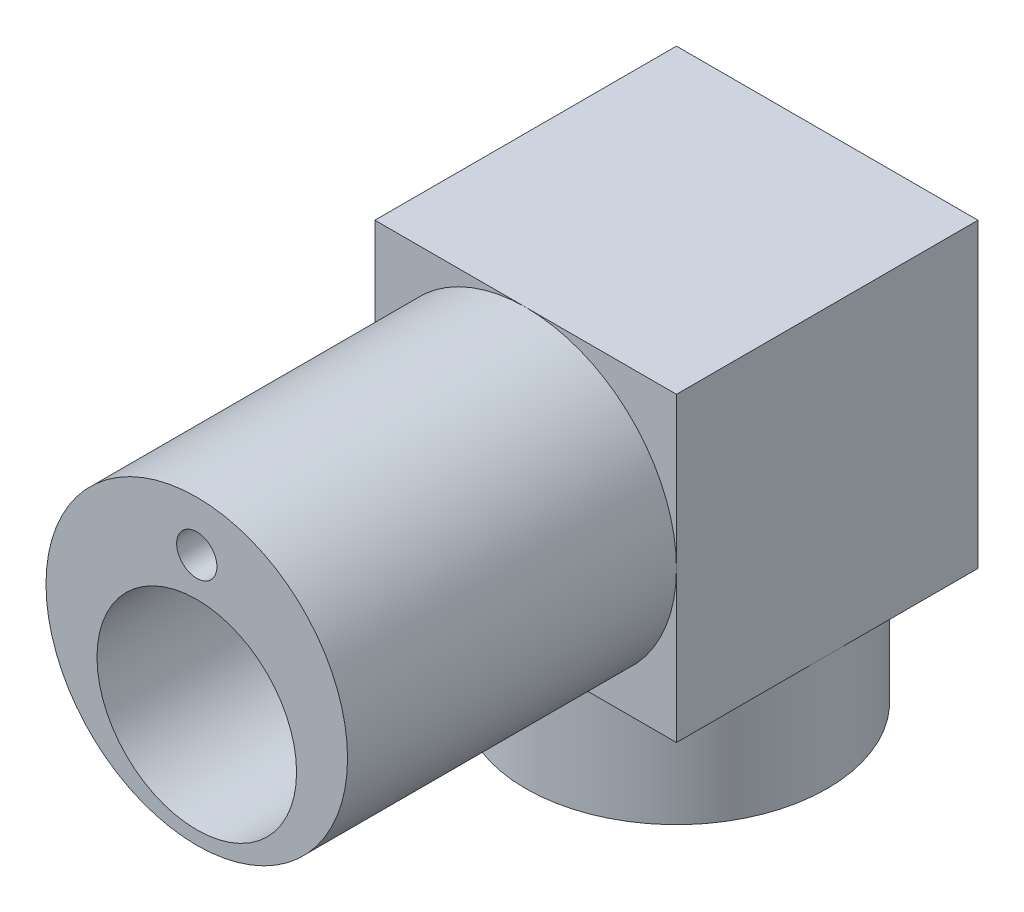
ISO-10303-21;
HEADER;
FILE_DESCRIPTION(('STEP AP214'),'2;1');
FILE_NAME('part.step','',(''),(''),'','','');
FILE_SCHEMA(('AUTOMOTIVE_DESIGN { 1 0 10303 214 1 1 1 1 }'));
ENDSEC;
DATA;
#1=APPLICATION_CONTEXT('core data for automotive mechanical design processes');
#2=APPLICATION_PROTOCOL_DEFINITION('international standard','automotive_design',2000,#1);
#3=PRODUCT_CONTEXT('',#1,'mechanical');
#4=PRODUCT('Part','Part','',(#3));
#5=PRODUCT_RELATED_PRODUCT_CATEGORY('part','',(#4));
#6=PRODUCT_DEFINITION_FORMATION('','',#4);
#7=PRODUCT_DEFINITION_CONTEXT('part definition',#1,'design');
#8=PRODUCT_DEFINITION('design','',#6,#7);
#9=PRODUCT_DEFINITION_SHAPE('','',#8);
#10=(LENGTH_UNIT() NAMED_UNIT(*) SI_UNIT(.MILLI.,.METRE.));
#11=(NAMED_UNIT(*) PLANE_ANGLE_UNIT() SI_UNIT($,.RADIAN.));
#12=(NAMED_UNIT(*) SI_UNIT($,.STERADIAN.) SOLID_ANGLE_UNIT());
#13=UNCERTAINTY_MEASURE_WITH_UNIT(LENGTH_MEASURE(1.E-05),#10,'distance_accuracy_value','');
#14=(GEOMETRIC_REPRESENTATION_CONTEXT(3) GLOBAL_UNCERTAINTY_ASSIGNED_CONTEXT((#13)) GLOBAL_UNIT_ASSIGNED_CONTEXT((#10,
#11,#12)) REPRESENTATION_CONTEXT('',''));
#15=CARTESIAN_POINT('',(0.,0.,0.));
#16=DIRECTION('',(0.,0.,1.));
#17=DIRECTION('',(1.,0.,0.));
#18=AXIS2_PLACEMENT_3D('',#15,#16,#17);
#19=CARTESIAN_POINT('',(28.1,-28.1,-56.2));
#20=DIRECTION('',(0.,1.,0.));
#21=DIRECTION('',(0.,0.,1.));
#22=AXIS2_PLACEMENT_3D('',#19,#20,#21);
#23=PLANE('',#22);
#24=CARTESIAN_POINT('',(0.,-28.1,-28.1));
#25=DIRECTION('',(0.,-1.,0.));
#26=DIRECTION('',(0.,0.,-1.));
#27=AXIS2_PLACEMENT_3D('',#24,#25,#26);
#28=CIRCLE('',#27,28.1);
#29=CARTESIAN_POINT('',(0.,-28.1,0.));
#30=VERTEX_POINT('',#29);
#31=CARTESIAN_POINT('',(-28.1,-28.1,-28.1));
#32=VERTEX_POINT('',#31);
#33=EDGE_CURVE('E377',#30,#32,#28,.T.);
#34=ORIENTED_EDGE('',*,*,#33,.F.);
#35=DIRECTION('',(-1.,0.,0.));
#36=VECTOR('',#35,1.);
#37=CARTESIAN_POINT('',(28.1,-28.1,0.));
#38=LINE('',#37,#36);
#39=CARTESIAN_POINT('',(-28.1,-28.1,0.));
#40=VERTEX_POINT('',#39);
#41=EDGE_CURVE('E281',#30,#40,#38,.T.);
#42=ORIENTED_EDGE('',*,*,#41,.T.);
#43=DIRECTION('',(0.,0.,1.));
#44=VECTOR('',#43,1.);
#45=CARTESIAN_POINT('',(-28.1,-28.1,-56.2));
#46=LINE('',#45,#44);
#47=EDGE_CURVE('E270',#32,#40,#46,.T.);
#48=ORIENTED_EDGE('',*,*,#47,.F.);
#49=EDGE_LOOP('',(#34,#42,#48));
#50=FACE_BOUND('',#49,.T.);
#51=ADVANCED_FACE('F33',(#50),#23,.F.);
#52=CARTESIAN_POINT('',(0.,-28.1,-56.2));
#53=VERTEX_POINT('',#52);
#54=EDGE_CURVE('E209',#32,#53,#28,.T.);
#55=ORIENTED_EDGE('',*,*,#54,.F.);
#56=CARTESIAN_POINT('',(-28.1,-28.1,-56.2));
#57=VERTEX_POINT('',#56);
#58=EDGE_CURVE('E284',#57,#32,#46,.T.);
#59=ORIENTED_EDGE('',*,*,#58,.F.);
#60=DIRECTION('',(-1.,0.,0.));
#61=VECTOR('',#60,1.);
#62=CARTESIAN_POINT('',(28.1,-28.1,-56.2));
#63=LINE('',#62,#61);
#64=EDGE_CURVE('E266',#53,#57,#63,.T.);
#65=ORIENTED_EDGE('',*,*,#64,.F.);
#66=EDGE_LOOP('',(#55,#59,#65));
#67=FACE_BOUND('',#66,.T.);
#68=ADVANCED_FACE('F332',(#67),#23,.F.);
#69=CARTESIAN_POINT('',(28.1,-28.1,-28.1));
#70=VERTEX_POINT('',#69);
#71=EDGE_CURVE('E216',#53,#70,#28,.T.);
#72=ORIENTED_EDGE('',*,*,#71,.F.);
#73=CARTESIAN_POINT('',(28.1,-28.1,-56.2));
#74=VERTEX_POINT('',#73);
#75=EDGE_CURVE('E267',#74,#53,#63,.T.);
#76=ORIENTED_EDGE('',*,*,#75,.F.);
#77=DIRECTION('',(0.,0.,1.));
#78=VECTOR('',#77,1.);
#79=CARTESIAN_POINT('',(28.1,-28.1,-56.2));
#80=LINE('',#79,#78);
#81=EDGE_CURVE('E288',#74,#70,#80,.T.);
#82=ORIENTED_EDGE('',*,*,#81,.T.);
#83=EDGE_LOOP('',(#72,#76,#82));
#84=FACE_BOUND('',#83,.T.);
#85=ADVANCED_FACE('F339',(#84),#23,.F.);
#86=CARTESIAN_POINT('',(0.,0.,61.3));
#87=DIRECTION('',(0.,0.,-1.));
#88=DIRECTION('',(-1.,0.,0.));
#89=AXIS2_PLACEMENT_3D('',#86,#87,#88);
#90=CYLINDRICAL_SURFACE('',#89,28.1);
#91=CARTESIAN_POINT('',(0.,0.,61.3));
#92=DIRECTION('',(0.,0.,1.));
#93=DIRECTION('',(1.,0.,0.));
#94=AXIS2_PLACEMENT_3D('',#91,#92,#93);
#95=CIRCLE('',#94,28.1);
#96=CARTESIAN_POINT('',(28.1,0.,61.3));
#97=VERTEX_POINT('',#96);
#98=EDGE_CURVE('E42',#97,#97,#95,.T.);
#99=ORIENTED_EDGE('',*,*,#98,.F.);
#100=EDGE_LOOP('',(#99));
#101=FACE_BOUND('',#100,.T.);
#102=CARTESIAN_POINT('',(0.,0.,0.));
#103=DIRECTION('',(0.,0.,1.));
#104=DIRECTION('',(1.,0.,0.));
#105=AXIS2_PLACEMENT_3D('',#102,#103,#104);
#106=CIRCLE('',#105,28.1);
#107=CARTESIAN_POINT('',(28.1,0.,0.));
#108=VERTEX_POINT('',#107);
#109=CARTESIAN_POINT('',(0.,28.1,0.));
#110=VERTEX_POINT('',#109);
#111=EDGE_CURVE('E306',#108,#110,#106,.T.);
#112=ORIENTED_EDGE('',*,*,#111,.T.);
#113=CARTESIAN_POINT('',(-28.1,0.,0.));
#114=VERTEX_POINT('',#113);
#115=EDGE_CURVE('E308',#110,#114,#106,.T.);
#116=ORIENTED_EDGE('',*,*,#115,.T.);
#117=EDGE_CURVE('E390',#114,#30,#106,.T.);
#118=ORIENTED_EDGE('',*,*,#117,.T.);
#119=EDGE_CURVE('E301',#30,#108,#106,.T.);
#120=ORIENTED_EDGE('',*,*,#119,.T.);
#121=EDGE_LOOP('',(#112,#116,#118,#120));
#122=FACE_BOUND('',#121,.T.);
#123=ADVANCED_FACE('F35',(#101,#122),#90,.T.);
#124=CARTESIAN_POINT('',(0.,0.,61.3));
#125=DIRECTION('',(0.,0.,1.));
#126=DIRECTION('',(1.,0.,0.));
#127=AXIS2_PLACEMENT_3D('',#124,#125,#126);
#128=PLANE('',#127);
#129=CARTESIAN_POINT('',(0.,18.75,61.3));
#130=DIRECTION('',(0.,0.,1.));
#131=DIRECTION('',(1.,0.,0.));
#132=AXIS2_PLACEMENT_3D('',#129,#130,#131);
#133=CIRCLE('',#132,3.75);
#134=CARTESIAN_POINT('',(3.75,18.75,61.3));
#135=VERTEX_POINT('',#134);
#136=EDGE_CURVE('E568',#135,#135,#133,.T.);
#137=ORIENTED_EDGE('',*,*,#136,.F.);
#138=EDGE_LOOP('',(#137));
#139=FACE_BOUND('',#138,.T.);
#140=CARTESIAN_POINT('',(0.,-7.,61.3));
#141=DIRECTION('',(0.,0.,1.));
#142=DIRECTION('',(1.,0.,0.));
#143=AXIS2_PLACEMENT_3D('',#140,#141,#142);
#144=CIRCLE('',#143,18.6);
#145=CARTESIAN_POINT('',(18.6,-7.,61.3));
#146=VERTEX_POINT('',#145);
#147=EDGE_CURVE('E297',#146,#146,#144,.T.);
#148=ORIENTED_EDGE('',*,*,#147,.F.);
#149=EDGE_LOOP('',(#148));
#150=FACE_BOUND('',#149,.T.);
#151=ORIENTED_EDGE('',*,*,#98,.T.);
#152=EDGE_LOOP('',(#151));
#153=FACE_BOUND('',#152,.T.);
#154=ADVANCED_FACE('F362',(#139,#150,#153),#128,.T.);
#155=CARTESIAN_POINT('',(0.,-7.,2.5));
#156=DIRECTION('',(0.,0.,1.));
#157=DIRECTION('',(1.,0.,0.));
#158=AXIS2_PLACEMENT_3D('',#155,#156,#157);
#159=CYLINDRICAL_SURFACE('',#158,18.6);
#160=CARTESIAN_POINT('',(0.,-7.,2.5));
#161=DIRECTION('',(0.,0.,1.));
#162=DIRECTION('',(1.,0.,0.));
#163=AXIS2_PLACEMENT_3D('',#160,#161,#162);
#164=CIRCLE('',#163,18.6);
#165=CARTESIAN_POINT('',(18.6,-7.,2.5));
#166=VERTEX_POINT('',#165);
#167=EDGE_CURVE('E298',#166,#166,#164,.T.);
#168=ORIENTED_EDGE('',*,*,#167,.F.);
#169=EDGE_LOOP('',(#168));
#170=FACE_BOUND('',#169,.T.);
#171=ORIENTED_EDGE('',*,*,#147,.T.);
#172=EDGE_LOOP('',(#171));
#173=FACE_BOUND('',#172,.T.);
#174=ADVANCED_FACE('F496',(#170,#173),#159,.F.);
#175=CARTESIAN_POINT('',(0.,-7.,2.5));
#176=DIRECTION('',(0.,0.,1.));
#177=DIRECTION('',(1.,0.,0.));
#178=AXIS2_PLACEMENT_3D('',#175,#176,#177);
#179=PLANE('',#178);
#180=CARTESIAN_POINT('',(0.,-7.,2.5));
#181=DIRECTION('',(0.,0.,1.));
#182=DIRECTION('',(1.,0.,0.));
#183=AXIS2_PLACEMENT_3D('',#180,#181,#182);
#184=CIRCLE('',#183,16.1);
#185=CARTESIAN_POINT('',(16.1,-7.,2.5));
#186=VERTEX_POINT('',#185);
#187=EDGE_CURVE('E254',#186,#186,#184,.T.);
#188=ORIENTED_EDGE('',*,*,#187,.F.);
#189=EDGE_LOOP('',(#188));
#190=FACE_BOUND('',#189,.T.);
#191=ORIENTED_EDGE('',*,*,#167,.T.);
#192=EDGE_LOOP('',(#191));
#193=FACE_BOUND('',#192,.T.);
#194=ADVANCED_FACE('F414',(#190,#193),#179,.T.);
#195=CARTESIAN_POINT('',(0.,0.,0.));
#196=DIRECTION('',(0.,0.,1.));
#197=DIRECTION('',(1.,0.,0.));
#198=AXIS2_PLACEMENT_3D('',#195,#196,#197);
#199=PLANE('',#198);
#200=ORIENTED_EDGE('',*,*,#111,.F.);
#201=DIRECTION('',(0.,-1.,0.));
#202=VECTOR('',#201,1.);
#203=CARTESIAN_POINT('',(28.1,-28.1,0.));
#204=LINE('',#203,#202);
#205=CARTESIAN_POINT('',(28.1,28.1,0.));
#206=VERTEX_POINT('',#205);
#207=EDGE_CURVE('E279',#206,#108,#204,.T.);
#208=ORIENTED_EDGE('',*,*,#207,.F.);
#209=DIRECTION('',(1.,0.,0.));
#210=VECTOR('',#209,1.);
#211=CARTESIAN_POINT('',(28.1,28.1,0.));
#212=LINE('',#211,#210);
#213=EDGE_CURVE('E274',#110,#206,#212,.T.);
#214=ORIENTED_EDGE('',*,*,#213,.F.);
#215=EDGE_LOOP('',(#200,#208,#214));
#216=FACE_BOUND('',#215,.T.);
#217=ADVANCED_FACE('F400',(#216),#199,.T.);
#218=ORIENTED_EDGE('',*,*,#115,.F.);
#219=CARTESIAN_POINT('',(-28.1,28.1,0.));
#220=VERTEX_POINT('',#219);
#221=EDGE_CURVE('E275',#220,#110,#212,.T.);
#222=ORIENTED_EDGE('',*,*,#221,.F.);
#223=DIRECTION('',(0.,1.,0.));
#224=VECTOR('',#223,1.);
#225=CARTESIAN_POINT('',(-28.1,-28.1,0.));
#226=LINE('',#225,#224);
#227=EDGE_CURVE('E257',#114,#220,#226,.T.);
#228=ORIENTED_EDGE('',*,*,#227,.F.);
#229=EDGE_LOOP('',(#218,#222,#228));
#230=FACE_BOUND('',#229,.T.);
#231=ADVANCED_FACE('F405',(#230),#199,.T.);
#232=ORIENTED_EDGE('',*,*,#117,.F.);
#233=EDGE_CURVE('E271',#40,#114,#226,.T.);
#234=ORIENTED_EDGE('',*,*,#233,.F.);
#235=ORIENTED_EDGE('',*,*,#41,.F.);
#236=EDGE_LOOP('',(#232,#234,#235));
#237=FACE_BOUND('',#236,.T.);
#238=ADVANCED_FACE('F407',(#237),#199,.T.);
#239=ORIENTED_EDGE('',*,*,#119,.F.);
#240=CARTESIAN_POINT('',(28.1,-28.1,0.));
#241=VERTEX_POINT('',#240);
#242=EDGE_CURVE('E262',#241,#30,#38,.T.);
#243=ORIENTED_EDGE('',*,*,#242,.F.);
#244=EDGE_CURVE('E278',#108,#241,#204,.T.);
#245=ORIENTED_EDGE('',*,*,#244,.F.);
#246=EDGE_LOOP('',(#239,#243,#245));
#247=FACE_BOUND('',#246,.T.);
#248=ADVANCED_FACE('F387',(#247),#199,.T.);
#249=CARTESIAN_POINT('',(-28.1,-28.1,-56.2));
#250=DIRECTION('',(1.,0.,0.));
#251=DIRECTION('',(0.,0.,-1.));
#252=AXIS2_PLACEMENT_3D('',#249,#250,#251);
#253=PLANE('',#252);
#254=ORIENTED_EDGE('',*,*,#233,.T.);
#255=ORIENTED_EDGE('',*,*,#227,.T.);
#256=DIRECTION('',(0.,0.,1.));
#257=VECTOR('',#256,1.);
#258=CARTESIAN_POINT('',(-28.1,28.1,-56.2));
#259=LINE('',#258,#257);
#260=CARTESIAN_POINT('',(-28.1,28.1,-56.2));
#261=VERTEX_POINT('',#260);
#262=EDGE_CURVE('E294',#261,#220,#259,.T.);
#263=ORIENTED_EDGE('',*,*,#262,.F.);
#264=DIRECTION('',(0.,1.,0.));
#265=VECTOR('',#264,1.);
#266=CARTESIAN_POINT('',(-28.1,-28.1,-56.2));
#267=LINE('',#266,#265);
#268=EDGE_CURVE('E258',#57,#261,#267,.T.);
#269=ORIENTED_EDGE('',*,*,#268,.F.);
#270=ORIENTED_EDGE('',*,*,#58,.T.);
#271=ORIENTED_EDGE('',*,*,#47,.T.);
#272=EDGE_LOOP('',(#254,#255,#263,#269,#270,#271));
#273=FACE_BOUND('',#272,.T.);
#274=ADVANCED_FACE('F394',(#273),#253,.F.);
#275=CARTESIAN_POINT('',(28.1,28.1,-56.2));
#276=DIRECTION('',(0.,-1.,0.));
#277=DIRECTION('',(0.,0.,-1.));
#278=AXIS2_PLACEMENT_3D('',#275,#276,#277);
#279=PLANE('',#278);
#280=ORIENTED_EDGE('',*,*,#221,.T.);
#281=ORIENTED_EDGE('',*,*,#213,.T.);
#282=DIRECTION('',(0.,0.,1.));
#283=VECTOR('',#282,1.);
#284=CARTESIAN_POINT('',(28.1,28.1,-56.2));
#285=LINE('',#284,#283);
#286=CARTESIAN_POINT('',(28.1,28.1,-56.2));
#287=VERTEX_POINT('',#286);
#288=EDGE_CURVE('E291',#287,#206,#285,.T.);
#289=ORIENTED_EDGE('',*,*,#288,.F.);
#290=DIRECTION('',(1.,0.,0.));
#291=VECTOR('',#290,1.);
#292=CARTESIAN_POINT('',(28.1,28.1,-56.2));
#293=LINE('',#292,#291);
#294=EDGE_CURVE('E261',#261,#287,#293,.T.);
#295=ORIENTED_EDGE('',*,*,#294,.F.);
#296=ORIENTED_EDGE('',*,*,#262,.T.);
#297=EDGE_LOOP('',(#280,#281,#289,#295,#296));
#298=FACE_BOUND('',#297,.T.);
#299=ADVANCED_FACE('F355',(#298),#279,.F.);
#300=CARTESIAN_POINT('',(28.1,-28.1,-56.2));
#301=DIRECTION('',(-1.,0.,0.));
#302=DIRECTION('',(0.,0.,1.));
#303=AXIS2_PLACEMENT_3D('',#300,#301,#302);
#304=PLANE('',#303);
#305=ORIENTED_EDGE('',*,*,#207,.T.);
#306=ORIENTED_EDGE('',*,*,#244,.T.);
#307=EDGE_CURVE('E287',#70,#241,#80,.T.);
#308=ORIENTED_EDGE('',*,*,#307,.F.);
#309=ORIENTED_EDGE('',*,*,#81,.F.);
#310=DIRECTION('',(0.,-1.,0.));
#311=VECTOR('',#310,1.);
#312=CARTESIAN_POINT('',(28.1,-28.1,-56.2));
#313=LINE('',#312,#311);
#314=EDGE_CURVE('E264',#287,#74,#313,.T.);
#315=ORIENTED_EDGE('',*,*,#314,.F.);
#316=ORIENTED_EDGE('',*,*,#288,.T.);
#317=EDGE_LOOP('',(#305,#306,#308,#309,#315,#316));
#318=FACE_BOUND('',#317,.T.);
#319=ADVANCED_FACE('F346',(#318),#304,.F.);
#320=EDGE_CURVE('E219',#70,#30,#28,.T.);
#321=ORIENTED_EDGE('',*,*,#320,.F.);
#322=ORIENTED_EDGE('',*,*,#307,.T.);
#323=ORIENTED_EDGE('',*,*,#242,.T.);
#324=EDGE_LOOP('',(#321,#322,#323));
#325=FACE_BOUND('',#324,.T.);
#326=ADVANCED_FACE('F335',(#325),#23,.F.);
#327=CARTESIAN_POINT('',(0.,0.,-56.2));
#328=DIRECTION('',(0.,0.,1.));
#329=DIRECTION('',(1.,0.,0.));
#330=AXIS2_PLACEMENT_3D('',#327,#328,#329);
#331=PLANE('',#330);
#332=DIRECTION('',(1.,0.,0.));
#333=VECTOR('',#332,1.);
#334=CARTESIAN_POINT('',(24.8986957114994,24.8896277262816,-56.2));
#335=LINE('',#334,#333);
#336=CARTESIAN_POINT('',(-24.8986957114994,24.8896277262816,-56.2));
#337=VERTEX_POINT('',#336);
#338=CARTESIAN_POINT('',(24.8986957114994,24.8896277262816,-56.2));
#339=VERTEX_POINT('',#338);
#340=EDGE_CURVE('E235',#337,#339,#335,.T.);
#341=ORIENTED_EDGE('',*,*,#340,.F.);
#342=DIRECTION('',(0.,1.,0.));
#343=VECTOR('',#342,1.);
#344=CARTESIAN_POINT('',(-24.8986957114994,-24.8896277262816,-56.2));
#345=LINE('',#344,#343);
#346=CARTESIAN_POINT('',(-24.8986957114994,-24.8896277262816,-56.2));
#347=VERTEX_POINT('',#346);
#348=EDGE_CURVE('E215',#347,#337,#345,.T.);
#349=ORIENTED_EDGE('',*,*,#348,.F.);
#350=DIRECTION('',(-1.,0.,0.));
#351=VECTOR('',#350,1.);
#352=CARTESIAN_POINT('',(24.8986957114994,-24.8896277262816,-56.2));
#353=LINE('',#352,#351);
#354=CARTESIAN_POINT('',(24.8986957114994,-24.8896277262816,-56.2));
#355=VERTEX_POINT('',#354);
#356=EDGE_CURVE('E224',#355,#347,#353,.T.);
#357=ORIENTED_EDGE('',*,*,#356,.F.);
#358=DIRECTION('',(0.,-1.,0.));
#359=VECTOR('',#358,1.);
#360=CARTESIAN_POINT('',(24.8986957114994,-24.8896277262816,-56.2));
#361=LINE('',#360,#359);
#362=EDGE_CURVE('E238',#339,#355,#361,.T.);
#363=ORIENTED_EDGE('',*,*,#362,.F.);
#364=EDGE_LOOP('',(#341,#349,#357,#363));
#365=FACE_BOUND('',#364,.T.);
#366=ORIENTED_EDGE('',*,*,#268,.T.);
#367=ORIENTED_EDGE('',*,*,#294,.T.);
#368=ORIENTED_EDGE('',*,*,#314,.T.);
#369=ORIENTED_EDGE('',*,*,#75,.T.);
#370=ORIENTED_EDGE('',*,*,#64,.T.);
#371=EDGE_LOOP('',(#366,#367,#368,#369,#370));
#372=FACE_BOUND('',#371,.T.);
#373=ADVANCED_FACE('F345',(#365,#372),#331,.F.);
#374=CARTESIAN_POINT('',(0.,-7.,-2.5));
#375=DIRECTION('',(0.,0.,1.));
#376=DIRECTION('',(1.,0.,0.));
#377=AXIS2_PLACEMENT_3D('',#374,#375,#376);
#378=CYLINDRICAL_SURFACE('',#377,16.1);
#379=CARTESIAN_POINT('',(0.,-7.,-2.5));
#380=DIRECTION('',(0.,0.,1.));
#381=DIRECTION('',(1.,0.,0.));
#382=AXIS2_PLACEMENT_3D('',#379,#380,#381);
#383=CIRCLE('',#382,16.1);
#384=CARTESIAN_POINT('',(16.1,-7.,-2.5));
#385=VERTEX_POINT('',#384);
#386=EDGE_CURVE('E245',#385,#385,#383,.T.);
#387=ORIENTED_EDGE('',*,*,#386,.F.);
#388=EDGE_LOOP('',(#387));
#389=FACE_BOUND('',#388,.T.);
#390=ORIENTED_EDGE('',*,*,#187,.T.);
#391=EDGE_LOOP('',(#390));
#392=FACE_BOUND('',#391,.T.);
#393=ADVANCED_FACE('F352',(#389,#392),#378,.F.);
#394=CARTESIAN_POINT('',(-24.8986957114994,-24.8896277262816,-2.5));
#395=DIRECTION('',(-1.,0.,0.));
#396=DIRECTION('',(0.,0.,1.));
#397=AXIS2_PLACEMENT_3D('',#394,#395,#396);
#398=PLANE('',#397);
#399=ORIENTED_EDGE('',*,*,#348,.T.);
#400=DIRECTION('',(0.,0.,-1.));
#401=VECTOR('',#400,1.);
#402=CARTESIAN_POINT('',(-24.8986957114994,24.8896277262816,-2.5));
#403=LINE('',#402,#401);
#404=CARTESIAN_POINT('',(-24.8986957114994,24.8896277262816,-2.5));
#405=VERTEX_POINT('',#404);
#406=EDGE_CURVE('E233',#405,#337,#403,.T.);
#407=ORIENTED_EDGE('',*,*,#406,.F.);
#408=DIRECTION('',(0.,1.,0.));
#409=VECTOR('',#408,1.);
#410=CARTESIAN_POINT('',(-24.8986957114994,-24.8896277262816,-2.5));
#411=LINE('',#410,#409);
#412=CARTESIAN_POINT('',(-24.8986957114994,-24.8896277262816,-2.5));
#413=VERTEX_POINT('',#412);
#414=EDGE_CURVE('E220',#413,#405,#411,.T.);
#415=ORIENTED_EDGE('',*,*,#414,.F.);
#416=DIRECTION('',(0.,0.,-1.));
#417=VECTOR('',#416,1.);
#418=CARTESIAN_POINT('',(-24.8986957114994,-24.8896277262816,-2.5));
#419=LINE('',#418,#417);
#420=EDGE_CURVE('E243',#413,#347,#419,.T.);
#421=ORIENTED_EDGE('',*,*,#420,.T.);
#422=EDGE_LOOP('',(#399,#407,#415,#421));
#423=FACE_BOUND('',#422,.T.);
#424=ADVANCED_FACE('F418',(#423),#398,.F.);
#425=CARTESIAN_POINT('',(24.8986957114994,-24.8896277262816,-2.5));
#426=DIRECTION('',(0.,-1.,0.));
#427=DIRECTION('',(0.,0.,-1.));
#428=AXIS2_PLACEMENT_3D('',#425,#426,#427);
#429=PLANE('',#428);
#430=CARTESIAN_POINT('',(0.,-24.8896277262816,-28.3320788958154));
#431=DIRECTION('',(0.,-1.,0.));
#432=DIRECTION('',(0.,0.,-1.));
#433=AXIS2_PLACEMENT_3D('',#430,#431,#432);
#434=CIRCLE('',#433,22.5);
#435=CARTESIAN_POINT('',(22.5,-24.8896277262816,-28.3320788958154));
#436=VERTEX_POINT('',#435);
#437=CARTESIAN_POINT('',(-22.5,-24.8896277262816,-28.3320788958154));
#438=VERTEX_POINT('',#437);
#439=EDGE_CURVE('E185',#436,#438,#434,.F.);
#440=ORIENTED_EDGE('',*,*,#439,.F.);
#441=CARTESIAN_POINT('',(18.75,-24.8896277262816,-28.3320788958154));
#442=DIRECTION('',(0.,-1.,0.));
#443=DIRECTION('',(0.,0.,-1.));
#444=AXIS2_PLACEMENT_3D('',#441,#442,#443);
#445=CIRCLE('',#444,3.75);
#446=CARTESIAN_POINT('',(15.,-24.8896277262816,-28.3320788958154));
#447=VERTEX_POINT('',#446);
#448=EDGE_CURVE('E50',#436,#447,#445,.T.);
#449=ORIENTED_EDGE('',*,*,#448,.T.);
#450=CARTESIAN_POINT('',(0.,-24.8896277262816,-28.3320788958154));
#451=DIRECTION('',(0.,-1.,0.));
#452=DIRECTION('',(0.,0.,-1.));
#453=AXIS2_PLACEMENT_3D('',#450,#451,#452);
#454=CIRCLE('',#453,15.);
#455=CARTESIAN_POINT('',(-15.,-24.8896277262816,-28.3320788958154));
#456=VERTEX_POINT('',#455);
#457=EDGE_CURVE('E188',#456,#447,#454,.T.);
#458=ORIENTED_EDGE('',*,*,#457,.F.);
#459=CARTESIAN_POINT('',(-18.75,-24.8896277262816,-28.3320788958154));
#460=DIRECTION('',(0.,-1.,0.));
#461=DIRECTION('',(0.,0.,-1.));
#462=AXIS2_PLACEMENT_3D('',#459,#460,#461);
#463=CIRCLE('',#462,3.75);
#464=EDGE_CURVE('E157',#456,#438,#463,.T.);
#465=ORIENTED_EDGE('',*,*,#464,.T.);
#466=EDGE_LOOP('',(#440,#449,#458,#465));
#467=FACE_BOUND('',#466,.T.);
#468=ORIENTED_EDGE('',*,*,#356,.T.);
#469=ORIENTED_EDGE('',*,*,#420,.F.);
#470=DIRECTION('',(-1.,0.,0.));
#471=VECTOR('',#470,1.);
#472=CARTESIAN_POINT('',(24.8986957114994,-24.8896277262816,-2.5));
#473=LINE('',#472,#471);
#474=CARTESIAN_POINT('',(24.8986957114994,-24.8896277262816,-2.5));
#475=VERTEX_POINT('',#474);
#476=EDGE_CURVE('E230',#475,#413,#473,.T.);
#477=ORIENTED_EDGE('',*,*,#476,.F.);
#478=DIRECTION('',(0.,0.,-1.));
#479=VECTOR('',#478,1.);
#480=CARTESIAN_POINT('',(24.8986957114994,-24.8896277262816,-2.5));
#481=LINE('',#480,#479);
#482=EDGE_CURVE('E246',#475,#355,#481,.T.);
#483=ORIENTED_EDGE('',*,*,#482,.T.);
#484=EDGE_LOOP('',(#468,#469,#477,#483));
#485=FACE_BOUND('',#484,.T.);
#486=ADVANCED_FACE('F422',(#467,#485),#429,.F.);
#487=CARTESIAN_POINT('',(24.8986957114994,-24.8896277262816,-2.5));
#488=DIRECTION('',(1.,0.,0.));
#489=DIRECTION('',(0.,0.,-1.));
#490=AXIS2_PLACEMENT_3D('',#487,#488,#489);
#491=PLANE('',#490);
#492=ORIENTED_EDGE('',*,*,#362,.T.);
#493=ORIENTED_EDGE('',*,*,#482,.F.);
#494=DIRECTION('',(0.,-1.,0.));
#495=VECTOR('',#494,1.);
#496=CARTESIAN_POINT('',(24.8986957114994,-24.8896277262816,-2.5));
#497=LINE('',#496,#495);
#498=CARTESIAN_POINT('',(24.8986957114994,24.8896277262816,-2.5));
#499=VERTEX_POINT('',#498);
#500=EDGE_CURVE('E227',#499,#475,#497,.T.);
#501=ORIENTED_EDGE('',*,*,#500,.F.);
#502=DIRECTION('',(0.,0.,-1.));
#503=VECTOR('',#502,1.);
#504=CARTESIAN_POINT('',(24.8986957114994,24.8896277262816,-2.5));
#505=LINE('',#504,#503);
#506=EDGE_CURVE('E248',#499,#339,#505,.T.);
#507=ORIENTED_EDGE('',*,*,#506,.T.);
#508=EDGE_LOOP('',(#492,#493,#501,#507));
#509=FACE_BOUND('',#508,.T.);
#510=ADVANCED_FACE('F428',(#509),#491,.F.);
#511=CARTESIAN_POINT('',(24.8986957114994,24.8896277262816,-2.5));
#512=DIRECTION('',(0.,1.,0.));
#513=DIRECTION('',(0.,0.,1.));
#514=AXIS2_PLACEMENT_3D('',#511,#512,#513);
#515=PLANE('',#514);
#516=ORIENTED_EDGE('',*,*,#340,.T.);
#517=ORIENTED_EDGE('',*,*,#506,.F.);
#518=DIRECTION('',(1.,0.,0.));
#519=VECTOR('',#518,1.);
#520=CARTESIAN_POINT('',(24.8986957114994,24.8896277262816,-2.5));
#521=LINE('',#520,#519);
#522=EDGE_CURVE('E223',#405,#499,#521,.T.);
#523=ORIENTED_EDGE('',*,*,#522,.F.);
#524=ORIENTED_EDGE('',*,*,#406,.T.);
#525=EDGE_LOOP('',(#516,#517,#523,#524));
#526=FACE_BOUND('',#525,.T.);
#527=ADVANCED_FACE('F424',(#526),#515,.F.);
#528=CARTESIAN_POINT('',(0.,0.,-2.5));
#529=DIRECTION('',(0.,0.,1.));
#530=DIRECTION('',(1.,0.,0.));
#531=AXIS2_PLACEMENT_3D('',#528,#529,#530);
#532=PLANE('',#531);
#533=CARTESIAN_POINT('',(0.,18.75,-2.5));
#534=DIRECTION('',(0.,0.,1.));
#535=DIRECTION('',(1.,0.,0.));
#536=AXIS2_PLACEMENT_3D('',#533,#534,#535);
#537=CIRCLE('',#536,3.75);
#538=CARTESIAN_POINT('',(3.75,18.75,-2.5));
#539=VERTEX_POINT('',#538);
#540=EDGE_CURVE('E37',#539,#539,#537,.T.);
#541=ORIENTED_EDGE('',*,*,#540,.T.);
#542=EDGE_LOOP('',(#541));
#543=FACE_BOUND('',#542,.T.);
#544=ORIENTED_EDGE('',*,*,#386,.T.);
#545=EDGE_LOOP('',(#544));
#546=FACE_BOUND('',#545,.T.);
#547=ORIENTED_EDGE('',*,*,#414,.T.);
#548=ORIENTED_EDGE('',*,*,#522,.T.);
#549=ORIENTED_EDGE('',*,*,#500,.T.);
#550=ORIENTED_EDGE('',*,*,#476,.T.);
#551=EDGE_LOOP('',(#547,#548,#549,#550));
#552=FACE_BOUND('',#551,.T.);
#553=ADVANCED_FACE('F427',(#543,#546,#552),#532,.F.);
#554=CARTESIAN_POINT('',(0.,-49.6,-28.1));
#555=DIRECTION('',(0.,1.,0.));
#556=DIRECTION('',(0.,0.,1.));
#557=AXIS2_PLACEMENT_3D('',#554,#555,#556);
#558=CYLINDRICAL_SURFACE('',#557,28.1);
#559=CARTESIAN_POINT('',(0.,-49.6,-28.1));
#560=DIRECTION('',(0.,-1.,0.));
#561=DIRECTION('',(0.,0.,-1.));
#562=AXIS2_PLACEMENT_3D('',#559,#560,#561);
#563=CIRCLE('',#562,28.1);
#564=CARTESIAN_POINT('',(0.,-49.6,-56.2));
#565=VERTEX_POINT('',#564);
#566=EDGE_CURVE('E212',#565,#565,#563,.T.);
#567=ORIENTED_EDGE('',*,*,#566,.F.);
#568=EDGE_LOOP('',(#567));
#569=FACE_BOUND('',#568,.T.);
#570=ORIENTED_EDGE('',*,*,#71,.T.);
#571=ORIENTED_EDGE('',*,*,#320,.T.);
#572=ORIENTED_EDGE('',*,*,#33,.T.);
#573=ORIENTED_EDGE('',*,*,#54,.T.);
#574=EDGE_LOOP('',(#570,#571,#572,#573));
#575=FACE_BOUND('',#574,.T.);
#576=ADVANCED_FACE('F376',(#569,#575),#558,.T.);
#577=CARTESIAN_POINT('',(0.,-49.6,-28.1));
#578=DIRECTION('',(0.,-1.,0.));
#579=DIRECTION('',(0.,0.,-1.));
#580=AXIS2_PLACEMENT_3D('',#577,#578,#579);
#581=PLANE('',#580);
#582=CARTESIAN_POINT('',(18.75,-49.6,-28.3320788958154));
#583=DIRECTION('',(0.,-1.,0.));
#584=DIRECTION('',(0.,0.,-1.));
#585=AXIS2_PLACEMENT_3D('',#582,#583,#584);
#586=CIRCLE('',#585,3.75);
#587=CARTESIAN_POINT('',(22.5,-49.6,-28.3320788958154));
#588=VERTEX_POINT('',#587);
#589=CARTESIAN_POINT('',(15.,-49.6,-28.3320788958154));
#590=VERTEX_POINT('',#589);
#591=EDGE_CURVE('E173',#588,#590,#586,.T.);
#592=ORIENTED_EDGE('',*,*,#591,.F.);
#593=CARTESIAN_POINT('',(0.,-49.6,-28.3320788958154));
#594=DIRECTION('',(0.,-1.,0.));
#595=DIRECTION('',(-1.,0.,0.));
#596=AXIS2_PLACEMENT_3D('',#593,#594,#595);
#597=CIRCLE('',#596,22.5);
#598=CARTESIAN_POINT('',(-22.5,-49.6,-28.3320788958154));
#599=VERTEX_POINT('',#598);
#600=EDGE_CURVE('E172',#599,#588,#597,.T.);
#601=ORIENTED_EDGE('',*,*,#600,.F.);
#602=CARTESIAN_POINT('',(-18.75,-49.6,-28.3320788958154));
#603=DIRECTION('',(0.,-1.,0.));
#604=DIRECTION('',(0.,0.,-1.));
#605=AXIS2_PLACEMENT_3D('',#602,#603,#604);
#606=CIRCLE('',#605,3.75);
#607=CARTESIAN_POINT('',(-15.,-49.6,-28.3320788958154));
#608=VERTEX_POINT('',#607);
#609=EDGE_CURVE('E58',#608,#599,#606,.T.);
#610=ORIENTED_EDGE('',*,*,#609,.F.);
#611=CARTESIAN_POINT('',(0.,-49.6,-28.3320788958154));
#612=DIRECTION('',(0.,-1.,0.));
#613=DIRECTION('',(-1.,0.,0.));
#614=AXIS2_PLACEMENT_3D('',#611,#612,#613);
#615=CIRCLE('',#614,15.);
#616=EDGE_CURVE('E170',#608,#590,#615,.T.);
#617=ORIENTED_EDGE('',*,*,#616,.T.);
#618=EDGE_LOOP('',(#592,#601,#610,#617));
#619=FACE_BOUND('',#618,.T.);
#620=CARTESIAN_POINT('',(0.,-49.6,-28.3320788958154));
#621=DIRECTION('',(0.,-1.,0.));
#622=DIRECTION('',(0.,0.,-1.));
#623=AXIS2_PLACEMENT_3D('',#620,#621,#622);
#624=CIRCLE('',#623,6.025);
#625=CARTESIAN_POINT('',(0.,-49.6,-34.3570788958154));
#626=VERTEX_POINT('',#625);
#627=EDGE_CURVE('E190',#626,#626,#624,.T.);
#628=ORIENTED_EDGE('',*,*,#627,.F.);
#629=EDGE_LOOP('',(#628));
#630=FACE_BOUND('',#629,.T.);
#631=ORIENTED_EDGE('',*,*,#566,.T.);
#632=EDGE_LOOP('',(#631));
#633=FACE_BOUND('',#632,.T.);
#634=ADVANCED_FACE('F168',(#619,#630,#633),#581,.T.);
#635=CARTESIAN_POINT('',(0.,-43.4,-28.3320788958154));
#636=DIRECTION('',(0.,-1.,0.));
#637=DIRECTION('',(0.,0.,-1.));
#638=AXIS2_PLACEMENT_3D('',#635,#636,#637);
#639=PLANE('',#638);
#640=CARTESIAN_POINT('',(0.,-43.4,-28.3320788958154));
#641=DIRECTION('',(0.,-1.,0.));
#642=DIRECTION('',(0.,0.,-1.));
#643=AXIS2_PLACEMENT_3D('',#640,#641,#642);
#644=CIRCLE('',#643,6.025);
#645=CARTESIAN_POINT('',(0.,-43.4,-34.3570788958154));
#646=VERTEX_POINT('',#645);
#647=EDGE_CURVE('E191',#646,#646,#644,.T.);
#648=ORIENTED_EDGE('',*,*,#647,.T.);
#649=EDGE_LOOP('',(#648));
#650=FACE_BOUND('',#649,.T.);
#651=CARTESIAN_POINT('',(0.,-43.4,-28.3320788958154));
#652=DIRECTION('',(0.,-1.,0.));
#653=DIRECTION('',(0.,0.,-1.));
#654=AXIS2_PLACEMENT_3D('',#651,#652,#653);
#655=CIRCLE('',#654,3.);
#656=CARTESIAN_POINT('',(0.,-43.4,-31.3320788958154));
#657=VERTEX_POINT('',#656);
#658=EDGE_CURVE('E194',#657,#657,#655,.F.);
#659=ORIENTED_EDGE('',*,*,#658,.T.);
#660=EDGE_LOOP('',(#659));
#661=FACE_BOUND('',#660,.T.);
#662=ADVANCED_FACE('F312',(#650,#661),#639,.T.);
#663=CARTESIAN_POINT('',(0.,-43.4,-28.3320788958154));
#664=DIRECTION('',(0.,-1.,0.));
#665=DIRECTION('',(0.,0.,-1.));
#666=AXIS2_PLACEMENT_3D('',#663,#664,#665);
#667=CYLINDRICAL_SURFACE('',#666,6.025);
#668=CARTESIAN_POINT('',(0.,-43.4,-34.3570788958154));
#669=CARTESIAN_POINT('',(0.,-43.4645833333333,-34.3570788958154));
#670=CARTESIAN_POINT('',(0.,-43.5291666666667,-34.3570788958154));
#671=CARTESIAN_POINT('',(0.,-43.6583333333333,-34.3570788958154));
#672=CARTESIAN_POINT('',(0.,-43.7229166666667,-34.3570788958154));
#673=CARTESIAN_POINT('',(0.,-43.8520833333333,-34.3570788958154));
#674=CARTESIAN_POINT('',(0.,-43.9166666666667,-34.3570788958154));
#675=CARTESIAN_POINT('',(0.,-44.0458333333333,-34.3570788958154));
#676=CARTESIAN_POINT('',(0.,-44.1104166666667,-34.3570788958154));
#677=CARTESIAN_POINT('',(0.,-44.2395833333333,-34.3570788958154));
#678=CARTESIAN_POINT('',(0.,-44.3041666666667,-34.3570788958154));
#679=CARTESIAN_POINT('',(0.,-44.4333333333333,-34.3570788958154));
#680=CARTESIAN_POINT('',(0.,-44.4979166666667,-34.3570788958154));
#681=CARTESIAN_POINT('',(0.,-44.6270833333333,-34.3570788958154));
#682=CARTESIAN_POINT('',(0.,-44.6916666666667,-34.3570788958154));
#683=CARTESIAN_POINT('',(0.,-44.8208333333333,-34.3570788958154));
#684=CARTESIAN_POINT('',(0.,-44.8854166666667,-34.3570788958154));
#685=CARTESIAN_POINT('',(0.,-45.0145833333333,-34.3570788958154));
#686=CARTESIAN_POINT('',(0.,-45.0791666666667,-34.3570788958154));
#687=CARTESIAN_POINT('',(0.,-45.2083333333333,-34.3570788958154));
#688=CARTESIAN_POINT('',(0.,-45.2729166666667,-34.3570788958154));
#689=CARTESIAN_POINT('',(0.,-45.4020833333333,-34.3570788958154));
#690=CARTESIAN_POINT('',(0.,-45.4666666666667,-34.3570788958154));
#691=CARTESIAN_POINT('',(0.,-45.5958333333333,-34.3570788958154));
#692=CARTESIAN_POINT('',(0.,-45.6604166666667,-34.3570788958154));
#693=CARTESIAN_POINT('',(0.,-45.7895833333333,-34.3570788958154));
#694=CARTESIAN_POINT('',(0.,-45.8541666666667,-34.3570788958154));
#695=CARTESIAN_POINT('',(0.,-45.9833333333333,-34.3570788958154));
#696=CARTESIAN_POINT('',(0.,-46.0479166666667,-34.3570788958154));
#697=CARTESIAN_POINT('',(0.,-46.1770833333333,-34.3570788958154));
#698=CARTESIAN_POINT('',(0.,-46.2416666666667,-34.3570788958154));
#699=CARTESIAN_POINT('',(0.,-46.3708333333333,-34.3570788958154));
#700=CARTESIAN_POINT('',(0.,-46.4354166666667,-34.3570788958154));
#701=CARTESIAN_POINT('',(0.,-46.5645833333333,-34.3570788958154));
#702=CARTESIAN_POINT('',(0.,-46.6291666666667,-34.3570788958154));
#703=CARTESIAN_POINT('',(0.,-46.7583333333333,-34.3570788958154));
#704=CARTESIAN_POINT('',(0.,-46.8229166666667,-34.3570788958154));
#705=CARTESIAN_POINT('',(0.,-46.9520833333333,-34.3570788958154));
#706=CARTESIAN_POINT('',(0.,-47.0166666666667,-34.3570788958154));
#707=CARTESIAN_POINT('',(0.,-47.1458333333333,-34.3570788958154));
#708=CARTESIAN_POINT('',(0.,-47.2104166666667,-34.3570788958154));
#709=CARTESIAN_POINT('',(0.,-47.3395833333333,-34.3570788958154));
#710=CARTESIAN_POINT('',(0.,-47.4041666666667,-34.3570788958154));
#711=CARTESIAN_POINT('',(0.,-47.5333333333333,-34.3570788958154));
#712=CARTESIAN_POINT('',(0.,-47.5979166666667,-34.3570788958154));
#713=CARTESIAN_POINT('',(0.,-47.7270833333333,-34.3570788958154));
#714=CARTESIAN_POINT('',(0.,-47.7916666666667,-34.3570788958154));
#715=CARTESIAN_POINT('',(0.,-47.9208333333333,-34.3570788958154));
#716=CARTESIAN_POINT('',(0.,-47.9854166666667,-34.3570788958154));
#717=CARTESIAN_POINT('',(0.,-48.1145833333333,-34.3570788958154));
#718=CARTESIAN_POINT('',(0.,-48.1791666666667,-34.3570788958154));
#719=CARTESIAN_POINT('',(0.,-48.3083333333333,-34.3570788958154));
#720=CARTESIAN_POINT('',(0.,-48.3729166666667,-34.3570788958154));
#721=CARTESIAN_POINT('',(0.,-48.5020833333333,-34.3570788958154));
#722=CARTESIAN_POINT('',(0.,-48.5666666666667,-34.3570788958154));
#723=CARTESIAN_POINT('',(0.,-48.6958333333333,-34.3570788958154));
#724=CARTESIAN_POINT('',(0.,-48.7604166666667,-34.3570788958154));
#725=CARTESIAN_POINT('',(0.,-48.8895833333333,-34.3570788958154));
#726=CARTESIAN_POINT('',(0.,-48.9541666666667,-34.3570788958154));
#727=CARTESIAN_POINT('',(0.,-49.0833333333333,-34.3570788958154));
#728=CARTESIAN_POINT('',(0.,-49.1479166666667,-34.3570788958154));
#729=CARTESIAN_POINT('',(0.,-49.2770833333333,-34.3570788958154));
#730=CARTESIAN_POINT('',(0.,-49.3416666666667,-34.3570788958154));
#731=CARTESIAN_POINT('',(0.,-49.4708333333333,-34.3570788958154));
#732=CARTESIAN_POINT('',(0.,-49.5354166666667,-34.3570788958154));
#733=CARTESIAN_POINT('',(0.,-49.6,-34.3570788958154));
#734=B_SPLINE_CURVE_WITH_KNOTS('',3,(#668,#669,#670,#671,#672,#673,#674,#675,#676,#677,#678,
#679,#680,#681,#682,#683,#684,#685,#686,#687,#688,#689,#690,#691,#692,#693,#694,#695,#696,#697,
#698,#699,#700,#701,#702,#703,#704,#705,#706,#707,#708,#709,#710,#711,#712,#713,#714,#715,#716,
#717,#718,#719,#720,#721,#722,#723,#724,#725,#726,#727,#728,#729,#730,#731,#732,#733),
.UNSPECIFIED.,.F.,.F.,(4,2,2,2,2,2,2,2,2,2,2,2,2,2,2,2,2,2,2,2,2,2,2,2,2,2,2,2,2,2,2,2,4),(0.,
0.193749999999999,0.387499999999999,0.581249999999998,0.774999999999998,0.968749999999997,
1.1625,1.35625,1.55,1.74375,1.93749999999999,2.13124999999999,2.32499999999999,2.51874999999999,
2.71249999999999,2.90624999999999,3.09999999999999,3.29375,3.4875,3.68125,3.875,4.06875,4.2625,
4.45625,4.64999999999999,4.84374999999999,5.03749999999999,5.23124999999999,5.42499999999999,
5.61874999999999,5.81249999999999,6.00624999999999,6.19999999999999),.UNSPECIFIED.);
#735=EDGE_CURVE('BSEAM445',#646,#626,#734,.T.);
#736=ORIENTED_EDGE('',*,*,#647,.F.);
#737=ORIENTED_EDGE('',*,*,#627,.T.);
#738=ORIENTED_EDGE('',*,*,#735,.T.);
#739=ORIENTED_EDGE('',*,*,#735,.F.);
#740=EDGE_LOOP('',(#736,#738,#737,#739));
#741=FACE_BOUND('',#740,.T.);
#742=ADVANCED_FACE('F445',(#741),#667,.F.);
#743=CARTESIAN_POINT('',(0.,-28.1,-28.3320788958154));
#744=DIRECTION('',(0.,-1.,0.));
#745=DIRECTION('',(0.,0.,-1.));
#746=AXIS2_PLACEMENT_3D('',#743,#744,#745);
#747=PLANE('',#746);
#748=CARTESIAN_POINT('',(0.,-28.1,-28.3320788958154));
#749=DIRECTION('',(0.,-1.,0.));
#750=DIRECTION('',(0.,0.,-1.));
#751=AXIS2_PLACEMENT_3D('',#748,#749,#750);
#752=CIRCLE('',#751,3.);
#753=CARTESIAN_POINT('',(-1.6583123951777,-28.1,-25.8320788958154));
#754=VERTEX_POINT('',#753);
#755=CARTESIAN_POINT('',(1.6583123951777,-28.1,-25.8320788958154));
#756=VERTEX_POINT('',#755);
#757=EDGE_CURVE('E199',#754,#756,#752,.T.);
#758=ORIENTED_EDGE('',*,*,#757,.T.);
#759=DIRECTION('',(-1.,0.,0.));
#760=VECTOR('',#759,1.);
#761=CARTESIAN_POINT('',(-1.6583123951777,-28.1,-25.8320788958154));
#762=LINE('',#761,#760);
#763=EDGE_CURVE('E202',#756,#754,#762,.T.);
#764=ORIENTED_EDGE('',*,*,#763,.T.);
#765=EDGE_LOOP('',(#758,#764));
#766=FACE_BOUND('',#765,.T.);
#767=ADVANCED_FACE('F451',(#766),#747,.T.);
#768=CARTESIAN_POINT('',(-1.6583123951777,-28.1,-25.8320788958154));
#769=DIRECTION('',(0.,0.,1.));
#770=DIRECTION('',(1.,0.,0.));
#771=AXIS2_PLACEMENT_3D('',#768,#769,#770);
#772=PLANE('',#771);
#773=DIRECTION('',(1.,0.,0.));
#774=VECTOR('',#773,1.);
#775=CARTESIAN_POINT('',(-1.6583123951777,-40.1,-25.8320788958154));
#776=LINE('',#775,#774);
#777=CARTESIAN_POINT('',(-1.6583123951777,-40.1,-25.8320788958154));
#778=VERTEX_POINT('',#777);
#779=CARTESIAN_POINT('',(1.65831239517772,-40.1,-25.8320788958154));
#780=VERTEX_POINT('',#779);
#781=EDGE_CURVE('E11',#778,#780,#776,.T.);
#782=ORIENTED_EDGE('',*,*,#781,.F.);
#783=DIRECTION('',(0.,-1.,0.));
#784=VECTOR('',#783,1.);
#785=CARTESIAN_POINT('',(-1.6583123951777,-28.1,-25.8320788958154));
#786=LINE('',#785,#784);
#787=EDGE_CURVE('E206',#754,#778,#786,.T.);
#788=ORIENTED_EDGE('',*,*,#787,.F.);
#789=ORIENTED_EDGE('',*,*,#763,.F.);
#790=DIRECTION('',(0.,-1.,0.));
#791=VECTOR('',#790,1.);
#792=CARTESIAN_POINT('',(1.6583123951777,-28.1,-25.8320788958154));
#793=LINE('',#792,#791);
#794=EDGE_CURVE('E205',#756,#780,#793,.T.);
#795=ORIENTED_EDGE('',*,*,#794,.T.);
#796=EDGE_LOOP('',(#782,#788,#789,#795));
#797=FACE_BOUND('',#796,.T.);
#798=ADVANCED_FACE('F325',(#797),#772,.F.);
#799=CARTESIAN_POINT('',(0.,-40.1,-28.3320788958154));
#800=DIRECTION('',(0.,-1.,0.));
#801=DIRECTION('',(0.,0.,-1.));
#802=AXIS2_PLACEMENT_3D('',#799,#800,#801);
#803=PLANE('',#802);
#804=ORIENTED_EDGE('',*,*,#781,.T.);
#805=CARTESIAN_POINT('',(0.,-40.1,-28.3320788958154));
#806=DIRECTION('',(0.,-1.,0.));
#807=DIRECTION('',(0.,0.,-1.));
#808=AXIS2_PLACEMENT_3D('',#805,#806,#807);
#809=CIRCLE('',#808,3.);
#810=EDGE_CURVE('E197',#780,#778,#809,.T.);
#811=ORIENTED_EDGE('',*,*,#810,.T.);
#812=EDGE_LOOP('',(#804,#811));
#813=FACE_BOUND('',#812,.T.);
#814=ADVANCED_FACE('F316',(#813),#803,.T.);
#815=CARTESIAN_POINT('',(0.,-28.1,-28.3320788958154));
#816=DIRECTION('',(0.,-1.,0.));
#817=DIRECTION('',(0.,0.,-1.));
#818=AXIS2_PLACEMENT_3D('',#815,#816,#817);
#819=CYLINDRICAL_SURFACE('',#818,3.);
#820=ORIENTED_EDGE('',*,*,#810,.F.);
#821=ORIENTED_EDGE('',*,*,#794,.F.);
#822=ORIENTED_EDGE('',*,*,#757,.F.);
#823=ORIENTED_EDGE('',*,*,#787,.T.);
#824=EDGE_LOOP('',(#820,#821,#822,#823));
#825=FACE_BOUND('',#824,.T.);
#826=ORIENTED_EDGE('',*,*,#658,.F.);
#827=EDGE_LOOP('',(#826));
#828=FACE_BOUND('',#827,.T.);
#829=ADVANCED_FACE('F314',(#825,#828),#819,.F.);
#830=CARTESIAN_POINT('',(0.,-49.6,-28.3320788958154));
#831=DIRECTION('',(0.,-1.,0.));
#832=DIRECTION('',(0.,0.,-1.));
#833=AXIS2_PLACEMENT_3D('',#830,#831,#832);
#834=CYLINDRICAL_SURFACE('',#833,15.);
#835=ORIENTED_EDGE('',*,*,#457,.T.);
#836=DIRECTION('',(0.,1.,0.));
#837=VECTOR('',#836,1.);
#838=CARTESIAN_POINT('',(15.,-49.6,-28.3320788958154));
#839=LINE('',#838,#837);
#840=EDGE_CURVE('E177',#590,#447,#839,.T.);
#841=ORIENTED_EDGE('',*,*,#840,.F.);
#842=ORIENTED_EDGE('',*,*,#616,.F.);
#843=DIRECTION('',(0.,1.,0.));
#844=VECTOR('',#843,1.);
#845=CARTESIAN_POINT('',(-15.,-49.6,-28.3320788958154));
#846=LINE('',#845,#844);
#847=EDGE_CURVE('E154',#608,#456,#846,.T.);
#848=ORIENTED_EDGE('',*,*,#847,.T.);
#849=EDGE_LOOP('',(#835,#841,#842,#848));
#850=FACE_BOUND('',#849,.T.);
#851=ADVANCED_FACE('F176',(#850),#834,.T.);
#852=CARTESIAN_POINT('',(0.,-49.6,-28.3320788958154));
#853=DIRECTION('',(0.,-1.,0.));
#854=DIRECTION('',(0.,0.,-1.));
#855=AXIS2_PLACEMENT_3D('',#852,#853,#854);
#856=CYLINDRICAL_SURFACE('',#855,22.5);
#857=ORIENTED_EDGE('',*,*,#439,.T.);
#858=DIRECTION('',(0.,-1.,0.));
#859=VECTOR('',#858,1.);
#860=CARTESIAN_POINT('',(-22.5,-49.6,-28.3320788958154));
#861=LINE('',#860,#859);
#862=EDGE_CURVE('E162',#438,#599,#861,.T.);
#863=ORIENTED_EDGE('',*,*,#862,.T.);
#864=ORIENTED_EDGE('',*,*,#600,.T.);
#865=DIRECTION('',(0.,-1.,0.));
#866=VECTOR('',#865,1.);
#867=CARTESIAN_POINT('',(22.5,-49.6,-28.3320788958154));
#868=LINE('',#867,#866);
#869=EDGE_CURVE('E179',#436,#588,#868,.T.);
#870=ORIENTED_EDGE('',*,*,#869,.F.);
#871=EDGE_LOOP('',(#857,#863,#864,#870));
#872=FACE_BOUND('',#871,.T.);
#873=ADVANCED_FACE('F323',(#872),#856,.F.);
#874=CARTESIAN_POINT('',(0.,18.75,-38.7));
#875=DIRECTION('',(0.,0.,1.));
#876=DIRECTION('',(1.,0.,0.));
#877=AXIS2_PLACEMENT_3D('',#874,#875,#876);
#878=CYLINDRICAL_SURFACE('',#877,3.75);
#879=ORIENTED_EDGE('',*,*,#136,.T.);
#880=EDGE_LOOP('',(#879));
#881=FACE_BOUND('',#880,.T.);
#882=ORIENTED_EDGE('',*,*,#540,.F.);
#883=EDGE_LOOP('',(#882));
#884=FACE_BOUND('',#883,.T.);
#885=ADVANCED_FACE('F512',(#881,#884),#878,.F.);
#886=CARTESIAN_POINT('',(-18.75,-24.6,-28.3320788958154));
#887=DIRECTION('',(0.,-1.,0.));
#888=DIRECTION('',(0.,0.,-1.));
#889=AXIS2_PLACEMENT_3D('',#886,#887,#888);
#890=CYLINDRICAL_SURFACE('',#889,3.75);
#891=ORIENTED_EDGE('',*,*,#847,.F.);
#892=ORIENTED_EDGE('',*,*,#609,.T.);
#893=ORIENTED_EDGE('',*,*,#862,.F.);
#894=ORIENTED_EDGE('',*,*,#464,.F.);
#895=EDGE_LOOP('',(#891,#892,#893,#894));
#896=FACE_BOUND('',#895,.T.);
#897=ADVANCED_FACE('F155',(#896),#890,.F.);
#898=CARTESIAN_POINT('',(18.75,-24.6,-28.3320788958154));
#899=DIRECTION('',(0.,-1.,0.));
#900=DIRECTION('',(0.,0.,-1.));
#901=AXIS2_PLACEMENT_3D('',#898,#899,#900);
#902=CYLINDRICAL_SURFACE('',#901,3.75);
#903=ORIENTED_EDGE('',*,*,#448,.F.);
#904=ORIENTED_EDGE('',*,*,#869,.T.);
#905=ORIENTED_EDGE('',*,*,#591,.T.);
#906=ORIENTED_EDGE('',*,*,#840,.T.);
#907=EDGE_LOOP('',(#903,#904,#905,#906));
#908=FACE_BOUND('',#907,.T.);
#909=ADVANCED_FACE('F553',(#908),#902,.F.);
#910=CLOSED_SHELL('',(#51,#68,#85,#123,#154,#174,#194,#217,#231,#238,#248,#274,#299,#319,#326,
#373,#393,#424,#486,#510,#527,#553,#576,#634,#662,#742,#767,#798,#814,#829,#851,#873,#885,#897,#909));
#911=MANIFOLD_SOLID_BREP('B2',#910);
#912=ADVANCED_BREP_SHAPE_REPRESENTATION('',(#18,#911),#14);
#913=SHAPE_DEFINITION_REPRESENTATION(#9,#912);
ENDSEC;
END-ISO-10303-21;
